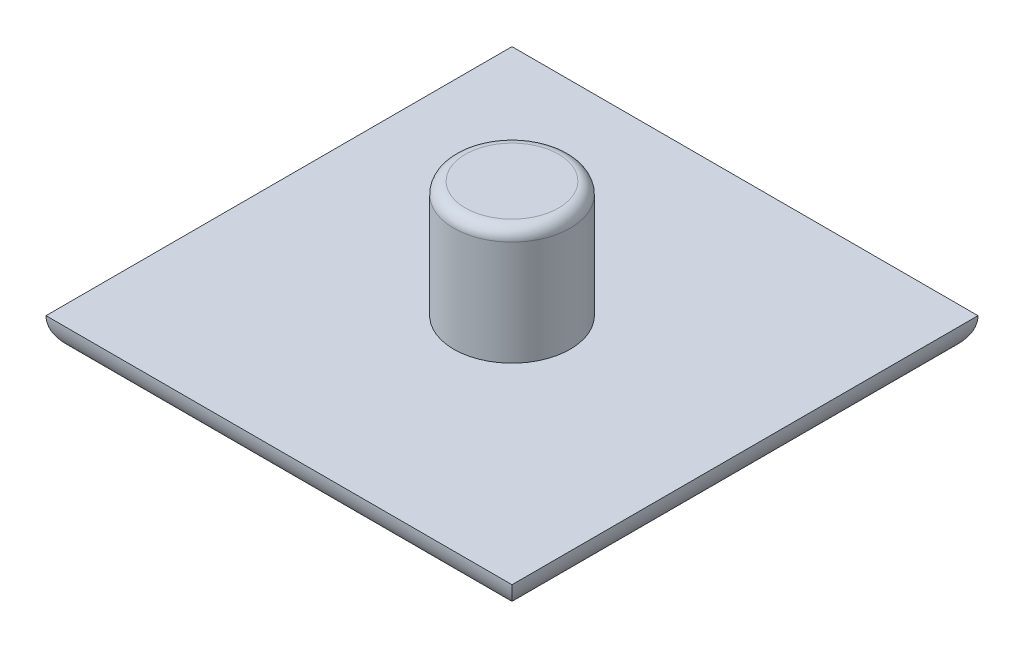
ISO-10303-21;
HEADER;
FILE_DESCRIPTION(('STEP AP214'),'2;1');
FILE_NAME('part.step','',(''),(''),'','','');
FILE_SCHEMA(('AUTOMOTIVE_DESIGN { 1 0 10303 214 1 1 1 1 }'));
ENDSEC;
DATA;
#1=APPLICATION_CONTEXT('core data for automotive mechanical design processes');
#2=APPLICATION_PROTOCOL_DEFINITION('international standard','automotive_design',2000,#1);
#3=PRODUCT_CONTEXT('',#1,'mechanical');
#4=PRODUCT('Part','Part','',(#3));
#5=PRODUCT_RELATED_PRODUCT_CATEGORY('part','',(#4));
#6=PRODUCT_DEFINITION_FORMATION('','',#4);
#7=PRODUCT_DEFINITION_CONTEXT('part definition',#1,'design');
#8=PRODUCT_DEFINITION('design','',#6,#7);
#9=PRODUCT_DEFINITION_SHAPE('','',#8);
#10=(LENGTH_UNIT() NAMED_UNIT(*) SI_UNIT(.MILLI.,.METRE.));
#11=(NAMED_UNIT(*) PLANE_ANGLE_UNIT() SI_UNIT($,.RADIAN.));
#12=(NAMED_UNIT(*) SI_UNIT($,.STERADIAN.) SOLID_ANGLE_UNIT());
#13=UNCERTAINTY_MEASURE_WITH_UNIT(LENGTH_MEASURE(1.E-05),#10,'distance_accuracy_value','');
#14=(GEOMETRIC_REPRESENTATION_CONTEXT(3) GLOBAL_UNCERTAINTY_ASSIGNED_CONTEXT((#13)) GLOBAL_UNIT_ASSIGNED_CONTEXT((#10,
#11,#12)) REPRESENTATION_CONTEXT('',''));
#15=CARTESIAN_POINT('',(0.,0.,0.));
#16=DIRECTION('',(0.,0.,1.));
#17=DIRECTION('',(1.,0.,0.));
#18=AXIS2_PLACEMENT_3D('',#15,#16,#17);
#19=CARTESIAN_POINT('',(0.,1.5,0.));
#20=DIRECTION('',(0.,1.,0.));
#21=DIRECTION('',(0.,0.,1.));
#22=AXIS2_PLACEMENT_3D('',#19,#20,#21);
#23=PLANE('',#22);
#24=CARTESIAN_POINT('',(0.,1.5,0.));
#25=DIRECTION('',(0.,1.,0.));
#26=DIRECTION('',(0.,0.,1.));
#27=AXIS2_PLACEMENT_3D('',#24,#25,#26);
#28=CIRCLE('',#27,2.5);
#29=CARTESIAN_POINT('',(0.,1.5,2.5));
#30=VERTEX_POINT('',#29);
#31=EDGE_CURVE('E86',#30,#30,#28,.T.);
#32=ORIENTED_EDGE('',*,*,#31,.F.);
#33=EDGE_LOOP('',(#32));
#34=FACE_BOUND('',#33,.T.);
#35=DIRECTION('',(0.,0.,-1.));
#36=VECTOR('',#35,1.);
#37=CARTESIAN_POINT('',(10.,1.5,-10.));
#38=LINE('',#37,#36);
#39=CARTESIAN_POINT('',(10.,1.5,10.));
#40=VERTEX_POINT('',#39);
#41=CARTESIAN_POINT('',(10.,1.5,-10.));
#42=VERTEX_POINT('',#41);
#43=EDGE_CURVE('E77',#40,#42,#38,.T.);
#44=ORIENTED_EDGE('',*,*,#43,.T.);
#45=DIRECTION('',(-1.,0.,0.));
#46=VECTOR('',#45,1.);
#47=CARTESIAN_POINT('',(-10.,1.5,-10.));
#48=LINE('',#47,#46);
#49=CARTESIAN_POINT('',(-10.,1.5,-10.));
#50=VERTEX_POINT('',#49);
#51=EDGE_CURVE('E79',#42,#50,#48,.T.);
#52=ORIENTED_EDGE('',*,*,#51,.T.);
#53=DIRECTION('',(0.,0.,1.));
#54=VECTOR('',#53,1.);
#55=CARTESIAN_POINT('',(-10.,1.5,-10.));
#56=LINE('',#55,#54);
#57=CARTESIAN_POINT('',(-10.,1.5,10.));
#58=VERTEX_POINT('',#57);
#59=EDGE_CURVE('E94',#50,#58,#56,.T.);
#60=ORIENTED_EDGE('',*,*,#59,.T.);
#61=DIRECTION('',(1.,0.,0.));
#62=VECTOR('',#61,1.);
#63=CARTESIAN_POINT('',(-10.,1.5,10.));
#64=LINE('',#63,#62);
#65=EDGE_CURVE('E82',#58,#40,#64,.T.);
#66=ORIENTED_EDGE('',*,*,#65,.T.);
#67=EDGE_LOOP('',(#44,#52,#60,#66));
#68=FACE_BOUND('',#67,.T.);
#69=ADVANCED_FACE('F36',(#34,#68),#23,.T.);
#70=CARTESIAN_POINT('',(0.,0.,0.));
#71=DIRECTION('',(0.,1.,0.));
#72=DIRECTION('',(0.,0.,1.));
#73=AXIS2_PLACEMENT_3D('',#70,#71,#72);
#74=PLANE('',#73);
#75=DIRECTION('',(0.,0.,-1.));
#76=VECTOR('',#75,1.);
#77=CARTESIAN_POINT('',(8.5,0.,0.));
#78=LINE('',#77,#76);
#79=CARTESIAN_POINT('',(8.5,0.,-8.5));
#80=VERTEX_POINT('',#79);
#81=CARTESIAN_POINT('',(8.5,0.,8.5));
#82=VERTEX_POINT('',#81);
#83=EDGE_CURVE('E51',#80,#82,#78,.F.);
#84=ORIENTED_EDGE('',*,*,#83,.T.);
#85=DIRECTION('',(1.,0.,0.));
#86=VECTOR('',#85,1.);
#87=CARTESIAN_POINT('',(0.,0.,8.5));
#88=LINE('',#87,#86);
#89=CARTESIAN_POINT('',(-8.5,0.,8.5));
#90=VERTEX_POINT('',#89);
#91=EDGE_CURVE('E104',#82,#90,#88,.F.);
#92=ORIENTED_EDGE('',*,*,#91,.T.);
#93=DIRECTION('',(0.,0.,1.));
#94=VECTOR('',#93,1.);
#95=CARTESIAN_POINT('',(-8.5,0.,0.));
#96=LINE('',#95,#94);
#97=CARTESIAN_POINT('',(-8.5,0.,-8.5));
#98=VERTEX_POINT('',#97);
#99=EDGE_CURVE('E115',#90,#98,#96,.F.);
#100=ORIENTED_EDGE('',*,*,#99,.T.);
#101=DIRECTION('',(-1.,0.,0.));
#102=VECTOR('',#101,1.);
#103=CARTESIAN_POINT('',(0.,0.,-8.5));
#104=LINE('',#103,#102);
#105=EDGE_CURVE('E56',#98,#80,#104,.F.);
#106=ORIENTED_EDGE('',*,*,#105,.T.);
#107=EDGE_LOOP('',(#84,#92,#100,#106));
#108=FACE_BOUND('',#107,.T.);
#109=ADVANCED_FACE('F127',(#108),#74,.F.);
#110=CARTESIAN_POINT('',(0.,6.5,0.));
#111=DIRECTION('',(0.,-1.,0.));
#112=DIRECTION('',(0.,0.,-1.));
#113=AXIS2_PLACEMENT_3D('',#110,#111,#112);
#114=CYLINDRICAL_SURFACE('',#113,2.5);
#115=CARTESIAN_POINT('',(0.,6.,0.));
#116=DIRECTION('',(0.,1.,0.));
#117=DIRECTION('',(0.,0.,1.));
#118=AXIS2_PLACEMENT_3D('',#115,#116,#117);
#119=CIRCLE('',#118,2.5);
#120=CARTESIAN_POINT('',(0.,6.,2.5));
#121=VERTEX_POINT('',#120);
#122=EDGE_CURVE('E11',#121,#121,#119,.F.);
#123=ORIENTED_EDGE('',*,*,#122,.T.);
#124=EDGE_LOOP('',(#123));
#125=FACE_BOUND('',#124,.T.);
#126=ORIENTED_EDGE('',*,*,#31,.T.);
#127=EDGE_LOOP('',(#126));
#128=FACE_BOUND('',#127,.T.);
#129=ADVANCED_FACE('F124',(#125,#128),#114,.T.);
#130=CARTESIAN_POINT('',(0.,6.5,0.));
#131=DIRECTION('',(0.,1.,0.));
#132=DIRECTION('',(0.,0.,1.));
#133=AXIS2_PLACEMENT_3D('',#130,#131,#132);
#134=PLANE('',#133);
#135=CARTESIAN_POINT('',(0.,6.5,0.));
#136=DIRECTION('',(0.,1.,0.));
#137=DIRECTION('',(0.,0.,1.));
#138=AXIS2_PLACEMENT_3D('',#135,#136,#137);
#139=CIRCLE('',#138,2.);
#140=CARTESIAN_POINT('',(0.,6.5,2.));
#141=VERTEX_POINT('',#140);
#142=EDGE_CURVE('E44',#141,#141,#139,.T.);
#143=ORIENTED_EDGE('',*,*,#142,.T.);
#144=EDGE_LOOP('',(#143));
#145=FACE_BOUND('',#144,.T.);
#146=ADVANCED_FACE('F142',(#145),#134,.T.);
#147=CARTESIAN_POINT('',(-10.,1.5,-8.5));
#148=DIRECTION('',(-1.,0.,0.));
#149=DIRECTION('',(0.,0.,1.));
#150=AXIS2_PLACEMENT_3D('',#147,#148,#149);
#151=CYLINDRICAL_SURFACE('',#150,1.5);
#152=CARTESIAN_POINT('',(8.5,1.5,-8.5));
#153=DIRECTION('',(-0.707106781186548,0.,-0.707106781186547));
#154=DIRECTION('',(-0.707106781186547,0.,0.707106781186548));
#155=AXIS2_PLACEMENT_3D('',#152,#153,#154);
#156=ELLIPSE('',#155,2.12132034355964,1.5);
#157=EDGE_CURVE('E90',#80,#42,#156,.F.);
#158=ORIENTED_EDGE('',*,*,#157,.F.);
#159=ORIENTED_EDGE('',*,*,#105,.F.);
#160=CARTESIAN_POINT('',(-8.5,1.5,-8.5));
#161=DIRECTION('',(-0.707106781186547,0.,0.707106781186548));
#162=DIRECTION('',(0.707106781186547,0.,0.707106781186547));
#163=AXIS2_PLACEMENT_3D('',#160,#161,#162);
#164=ELLIPSE('',#163,2.12132034355964,1.5);
#165=EDGE_CURVE('E92',#50,#98,#164,.T.);
#166=ORIENTED_EDGE('',*,*,#165,.F.);
#167=ORIENTED_EDGE('',*,*,#51,.F.);
#168=EDGE_LOOP('',(#158,#159,#166,#167));
#169=FACE_BOUND('',#168,.T.);
#170=ADVANCED_FACE('F89',(#169),#151,.T.);
#171=CARTESIAN_POINT('',(-8.5,1.5,-10.));
#172=DIRECTION('',(0.,0.,1.));
#173=DIRECTION('',(1.,0.,0.));
#174=AXIS2_PLACEMENT_3D('',#171,#172,#173);
#175=CYLINDRICAL_SURFACE('',#174,1.5);
#176=ORIENTED_EDGE('',*,*,#165,.T.);
#177=ORIENTED_EDGE('',*,*,#99,.F.);
#178=CARTESIAN_POINT('',(-8.5,1.5,8.5));
#179=DIRECTION('',(0.707106781186547,0.,0.707106781186547));
#180=DIRECTION('',(-0.707106781186547,0.,0.707106781186548));
#181=AXIS2_PLACEMENT_3D('',#178,#179,#180);
#182=ELLIPSE('',#181,2.12132034355964,1.5);
#183=EDGE_CURVE('E97',#58,#90,#182,.T.);
#184=ORIENTED_EDGE('',*,*,#183,.F.);
#185=ORIENTED_EDGE('',*,*,#59,.F.);
#186=EDGE_LOOP('',(#176,#177,#184,#185));
#187=FACE_BOUND('',#186,.T.);
#188=ADVANCED_FACE('F116',(#187),#175,.T.);
#189=CARTESIAN_POINT('',(8.5,1.5,-10.));
#190=DIRECTION('',(0.,0.,-1.));
#191=DIRECTION('',(-1.,0.,0.));
#192=AXIS2_PLACEMENT_3D('',#189,#190,#191);
#193=CYLINDRICAL_SURFACE('',#192,1.5);
#194=ORIENTED_EDGE('',*,*,#157,.T.);
#195=ORIENTED_EDGE('',*,*,#43,.F.);
#196=CARTESIAN_POINT('',(8.5,1.5,8.5));
#197=DIRECTION('',(0.707106781186547,0.,-0.707106781186548));
#198=DIRECTION('',(-0.707106781186548,0.,-0.707106781186547));
#199=AXIS2_PLACEMENT_3D('',#196,#197,#198);
#200=ELLIPSE('',#199,2.12132034355964,1.5);
#201=EDGE_CURVE('E100',#82,#40,#200,.F.);
#202=ORIENTED_EDGE('',*,*,#201,.F.);
#203=ORIENTED_EDGE('',*,*,#83,.F.);
#204=EDGE_LOOP('',(#194,#195,#202,#203));
#205=FACE_BOUND('',#204,.T.);
#206=ADVANCED_FACE('F96',(#205),#193,.T.);
#207=CARTESIAN_POINT('',(-10.,1.5,8.5));
#208=DIRECTION('',(1.,0.,0.));
#209=DIRECTION('',(0.,0.,-1.));
#210=AXIS2_PLACEMENT_3D('',#207,#208,#209);
#211=CYLINDRICAL_SURFACE('',#210,1.5);
#212=ORIENTED_EDGE('',*,*,#183,.T.);
#213=ORIENTED_EDGE('',*,*,#91,.F.);
#214=ORIENTED_EDGE('',*,*,#201,.T.);
#215=ORIENTED_EDGE('',*,*,#65,.F.);
#216=EDGE_LOOP('',(#212,#213,#214,#215));
#217=FACE_BOUND('',#216,.T.);
#218=ADVANCED_FACE('F111',(#217),#211,.T.);
#219=CARTESIAN_POINT('',(0.,6.,0.));
#220=DIRECTION('',(0.,1.,0.));
#221=DIRECTION('',(0.,0.,1.));
#222=AXIS2_PLACEMENT_3D('',#219,#220,#221);
#223=TOROIDAL_SURFACE('',#222,2.,0.5);
#224=ORIENTED_EDGE('',*,*,#122,.F.);
#225=EDGE_LOOP('',(#224));
#226=FACE_BOUND('',#225,.T.);
#227=ORIENTED_EDGE('',*,*,#142,.F.);
#228=EDGE_LOOP('',(#227));
#229=FACE_BOUND('',#228,.T.);
#230=ADVANCED_FACE('F38',(#226,#229),#223,.T.);
#231=CLOSED_SHELL('',(#69,#109,#129,#146,#170,#188,#206,#218,#230));
#232=MANIFOLD_SOLID_BREP('B2',#231);
#233=ADVANCED_BREP_SHAPE_REPRESENTATION('',(#18,#232),#14);
#234=SHAPE_DEFINITION_REPRESENTATION(#9,#233);
ENDSEC;
END-ISO-10303-21;
